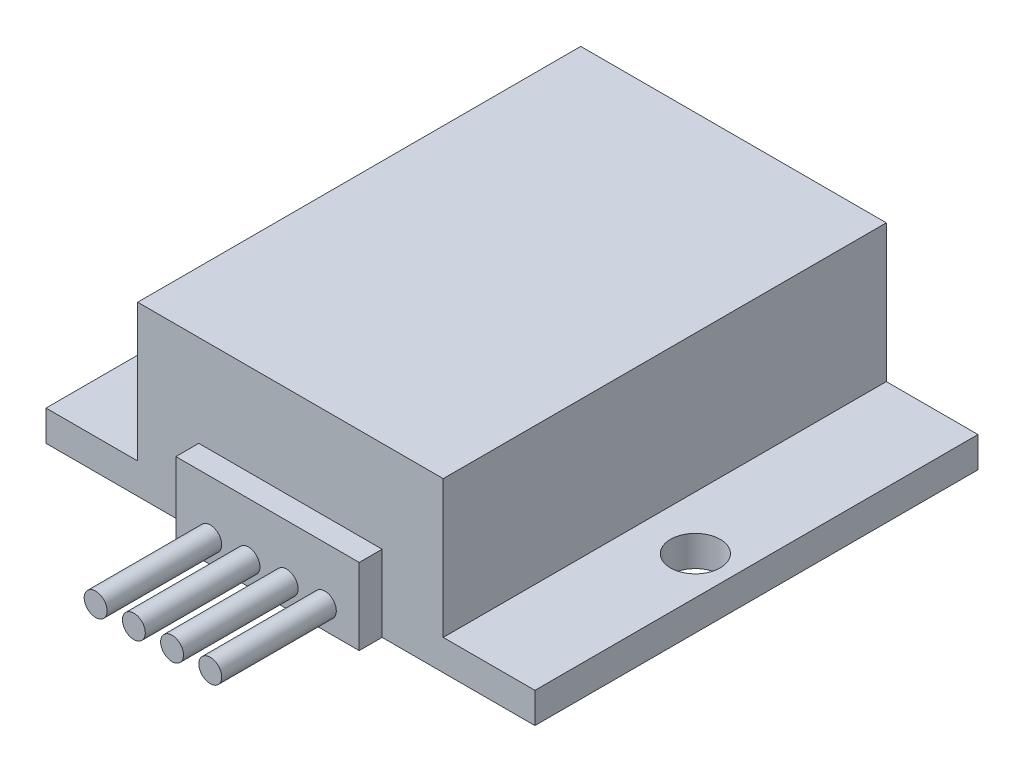
ISO-10303-21;
HEADER;
FILE_DESCRIPTION(('STEP AP214'),'2;1');
FILE_NAME('part.step','',(''),(''),'','','');
FILE_SCHEMA(('AUTOMOTIVE_DESIGN { 1 0 10303 214 1 1 1 1 }'));
ENDSEC;
DATA;
#1=APPLICATION_CONTEXT('core data for automotive mechanical design processes');
#2=APPLICATION_PROTOCOL_DEFINITION('international standard','automotive_design',2000,#1);
#3=PRODUCT_CONTEXT('',#1,'mechanical');
#4=PRODUCT('Part','Part','',(#3));
#5=PRODUCT_RELATED_PRODUCT_CATEGORY('part','',(#4));
#6=PRODUCT_DEFINITION_FORMATION('','',#4);
#7=PRODUCT_DEFINITION_CONTEXT('part definition',#1,'design');
#8=PRODUCT_DEFINITION('design','',#6,#7);
#9=PRODUCT_DEFINITION_SHAPE('','',#8);
#10=(LENGTH_UNIT() NAMED_UNIT(*) SI_UNIT(.MILLI.,.METRE.));
#11=(NAMED_UNIT(*) PLANE_ANGLE_UNIT() SI_UNIT($,.RADIAN.));
#12=(NAMED_UNIT(*) SI_UNIT($,.STERADIAN.) SOLID_ANGLE_UNIT());
#13=UNCERTAINTY_MEASURE_WITH_UNIT(LENGTH_MEASURE(1.E-05),#10,'distance_accuracy_value','');
#14=(GEOMETRIC_REPRESENTATION_CONTEXT(3) GLOBAL_UNCERTAINTY_ASSIGNED_CONTEXT((#13)) GLOBAL_UNIT_ASSIGNED_CONTEXT((#10,
#11,#12)) REPRESENTATION_CONTEXT('',''));
#15=CARTESIAN_POINT('',(0.,0.,0.));
#16=DIRECTION('',(0.,0.,1.));
#17=DIRECTION('',(1.,0.,0.));
#18=AXIS2_PLACEMENT_3D('',#15,#16,#17);
#19=CARTESIAN_POINT('',(0.,4.,29.));
#20=DIRECTION('',(0.,0.,-1.));
#21=DIRECTION('',(-1.,0.,0.));
#22=AXIS2_PLACEMENT_3D('',#19,#20,#21);
#23=PLANE('',#22);
#24=DIRECTION('',(0.,-1.,0.));
#25=VECTOR('',#24,1.);
#26=CARTESIAN_POINT('',(-12.,10.,29.));
#27=LINE('',#26,#25);
#28=CARTESIAN_POINT('',(-12.,10.,29.));
#29=VERTEX_POINT('',#28);
#30=CARTESIAN_POINT('',(-12.,0.,29.));
#31=VERTEX_POINT('',#30);
#32=EDGE_CURVE('E152',#29,#31,#27,.T.);
#33=ORIENTED_EDGE('',*,*,#32,.F.);
#34=DIRECTION('',(1.,0.,0.));
#35=VECTOR('',#34,1.);
#36=CARTESIAN_POINT('',(0.,10.,29.));
#37=LINE('',#36,#35);
#38=CARTESIAN_POINT('',(12.,10.,29.));
#39=VERTEX_POINT('',#38);
#40=EDGE_CURVE('E133',#29,#39,#37,.T.);
#41=ORIENTED_EDGE('',*,*,#40,.T.);
#42=DIRECTION('',(0.,-1.,0.));
#43=VECTOR('',#42,1.);
#44=CARTESIAN_POINT('',(12.,10.,29.));
#45=LINE('',#44,#43);
#46=CARTESIAN_POINT('',(12.,0.,29.));
#47=VERTEX_POINT('',#46);
#48=EDGE_CURVE('E129',#39,#47,#45,.T.);
#49=ORIENTED_EDGE('',*,*,#48,.T.);
#50=DIRECTION('',(1.,0.,0.));
#51=VECTOR('',#50,1.);
#52=CARTESIAN_POINT('',(0.,0.,29.));
#53=LINE('',#52,#51);
#54=CARTESIAN_POINT('',(32.,0.,29.));
#55=VERTEX_POINT('',#54);
#56=EDGE_CURVE('E215',#47,#55,#53,.T.);
#57=ORIENTED_EDGE('',*,*,#56,.T.);
#58=DIRECTION('',(0.,-1.,0.));
#59=VECTOR('',#58,1.);
#60=CARTESIAN_POINT('',(32.,4.,29.));
#61=LINE('',#60,#59);
#62=CARTESIAN_POINT('',(32.,4.,29.));
#63=VERTEX_POINT('',#62);
#64=EDGE_CURVE('E173',#63,#55,#61,.T.);
#65=ORIENTED_EDGE('',*,*,#64,.F.);
#66=DIRECTION('',(1.,0.,0.));
#67=VECTOR('',#66,1.);
#68=CARTESIAN_POINT('',(0.,4.,29.));
#69=LINE('',#68,#67);
#70=CARTESIAN_POINT('',(20.,4.,29.));
#71=VERTEX_POINT('',#70);
#72=EDGE_CURVE('E163',#71,#63,#69,.T.);
#73=ORIENTED_EDGE('',*,*,#72,.F.);
#74=DIRECTION('',(0.,-1.,0.));
#75=VECTOR('',#74,1.);
#76=CARTESIAN_POINT('',(20.,22.,29.));
#77=LINE('',#76,#75);
#78=CARTESIAN_POINT('',(20.,22.,29.));
#79=VERTEX_POINT('',#78);
#80=EDGE_CURVE('E186',#79,#71,#77,.T.);
#81=ORIENTED_EDGE('',*,*,#80,.F.);
#82=DIRECTION('',(1.,0.,0.));
#83=VECTOR('',#82,1.);
#84=CARTESIAN_POINT('',(0.,22.,29.));
#85=LINE('',#84,#83);
#86=CARTESIAN_POINT('',(-20.,22.,29.));
#87=VERTEX_POINT('',#86);
#88=EDGE_CURVE('E184',#87,#79,#85,.T.);
#89=ORIENTED_EDGE('',*,*,#88,.F.);
#90=DIRECTION('',(0.,-1.,0.));
#91=VECTOR('',#90,1.);
#92=CARTESIAN_POINT('',(-20.,22.,29.));
#93=LINE('',#92,#91);
#94=CARTESIAN_POINT('',(-20.,4.,29.));
#95=VERTEX_POINT('',#94);
#96=EDGE_CURVE('E188',#87,#95,#93,.T.);
#97=ORIENTED_EDGE('',*,*,#96,.T.);
#98=DIRECTION('',(1.,0.,0.));
#99=VECTOR('',#98,1.);
#100=CARTESIAN_POINT('',(0.,4.,29.));
#101=LINE('',#100,#99);
#102=CARTESIAN_POINT('',(-32.,4.,29.));
#103=VERTEX_POINT('',#102);
#104=EDGE_CURVE('E206',#103,#95,#101,.T.);
#105=ORIENTED_EDGE('',*,*,#104,.F.);
#106=DIRECTION('',(0.,-1.,0.));
#107=VECTOR('',#106,1.);
#108=CARTESIAN_POINT('',(-32.,4.,29.));
#109=LINE('',#108,#107);
#110=CARTESIAN_POINT('',(-32.,0.,29.));
#111=VERTEX_POINT('',#110);
#112=EDGE_CURVE('E211',#103,#111,#109,.T.);
#113=ORIENTED_EDGE('',*,*,#112,.T.);
#114=EDGE_CURVE('E216',#111,#31,#53,.T.);
#115=ORIENTED_EDGE('',*,*,#114,.T.);
#116=EDGE_LOOP('',(#33,#41,#49,#57,#65,#73,#81,#89,#97,#105,#113,#115));
#117=FACE_BOUND('',#116,.T.);
#118=ADVANCED_FACE('F36',(#117),#23,.F.);
#119=CARTESIAN_POINT('',(0.,4.,-29.));
#120=DIRECTION('',(0.,0.,-1.));
#121=DIRECTION('',(-1.,0.,0.));
#122=AXIS2_PLACEMENT_3D('',#119,#120,#121);
#123=PLANE('',#122);
#124=DIRECTION('',(1.,0.,0.));
#125=VECTOR('',#124,1.);
#126=CARTESIAN_POINT('',(0.,0.,-29.));
#127=LINE('',#126,#125);
#128=CARTESIAN_POINT('',(-32.,0.,-29.));
#129=VERTEX_POINT('',#128);
#130=CARTESIAN_POINT('',(32.,0.,-29.));
#131=VERTEX_POINT('',#130);
#132=EDGE_CURVE('E196',#129,#131,#127,.T.);
#133=ORIENTED_EDGE('',*,*,#132,.F.);
#134=DIRECTION('',(0.,-1.,0.));
#135=VECTOR('',#134,1.);
#136=CARTESIAN_POINT('',(-32.,4.,-29.));
#137=LINE('',#136,#135);
#138=CARTESIAN_POINT('',(-32.,4.,-29.));
#139=VERTEX_POINT('',#138);
#140=EDGE_CURVE('E223',#139,#129,#137,.T.);
#141=ORIENTED_EDGE('',*,*,#140,.F.);
#142=DIRECTION('',(1.,0.,0.));
#143=VECTOR('',#142,1.);
#144=CARTESIAN_POINT('',(0.,4.,-29.));
#145=LINE('',#144,#143);
#146=CARTESIAN_POINT('',(-20.,4.,-29.));
#147=VERTEX_POINT('',#146);
#148=EDGE_CURVE('E200',#139,#147,#145,.T.);
#149=ORIENTED_EDGE('',*,*,#148,.T.);
#150=DIRECTION('',(0.,-1.,0.));
#151=VECTOR('',#150,1.);
#152=CARTESIAN_POINT('',(-20.,22.,-29.));
#153=LINE('',#152,#151);
#154=CARTESIAN_POINT('',(-20.,22.,-29.));
#155=VERTEX_POINT('',#154);
#156=EDGE_CURVE('E191',#155,#147,#153,.T.);
#157=ORIENTED_EDGE('',*,*,#156,.F.);
#158=DIRECTION('',(1.,0.,0.));
#159=VECTOR('',#158,1.);
#160=CARTESIAN_POINT('',(0.,22.,-29.));
#161=LINE('',#160,#159);
#162=CARTESIAN_POINT('',(20.,22.,-29.));
#163=VERTEX_POINT('',#162);
#164=EDGE_CURVE('E179',#155,#163,#161,.T.);
#165=ORIENTED_EDGE('',*,*,#164,.T.);
#166=DIRECTION('',(0.,-1.,0.));
#167=VECTOR('',#166,1.);
#168=CARTESIAN_POINT('',(20.,22.,-29.));
#169=LINE('',#168,#167);
#170=CARTESIAN_POINT('',(20.,4.,-29.));
#171=VERTEX_POINT('',#170);
#172=EDGE_CURVE('E194',#163,#171,#169,.T.);
#173=ORIENTED_EDGE('',*,*,#172,.T.);
#174=DIRECTION('',(1.,0.,0.));
#175=VECTOR('',#174,1.);
#176=CARTESIAN_POINT('',(0.,4.,-29.));
#177=LINE('',#176,#175);
#178=CARTESIAN_POINT('',(32.,4.,-29.));
#179=VERTEX_POINT('',#178);
#180=EDGE_CURVE('E159',#171,#179,#177,.T.);
#181=ORIENTED_EDGE('',*,*,#180,.T.);
#182=DIRECTION('',(0.,-1.,0.));
#183=VECTOR('',#182,1.);
#184=CARTESIAN_POINT('',(32.,4.,-29.));
#185=LINE('',#184,#183);
#186=EDGE_CURVE('E167',#179,#131,#185,.T.);
#187=ORIENTED_EDGE('',*,*,#186,.T.);
#188=EDGE_LOOP('',(#133,#141,#149,#157,#165,#173,#181,#187));
#189=FACE_BOUND('',#188,.T.);
#190=ADVANCED_FACE('F38',(#189),#123,.T.);
#191=CARTESIAN_POINT('',(-32.,4.,0.));
#192=DIRECTION('',(1.,0.,0.));
#193=DIRECTION('',(0.,0.,-1.));
#194=AXIS2_PLACEMENT_3D('',#191,#192,#193);
#195=PLANE('',#194);
#196=DIRECTION('',(0.,0.,1.));
#197=VECTOR('',#196,1.);
#198=CARTESIAN_POINT('',(-32.,0.,0.));
#199=LINE('',#198,#197);
#200=EDGE_CURVE('E213',#129,#111,#199,.T.);
#201=ORIENTED_EDGE('',*,*,#200,.T.);
#202=ORIENTED_EDGE('',*,*,#112,.F.);
#203=DIRECTION('',(0.,0.,1.));
#204=VECTOR('',#203,1.);
#205=CARTESIAN_POINT('',(-32.,4.,0.));
#206=LINE('',#205,#204);
#207=EDGE_CURVE('E204',#139,#103,#206,.T.);
#208=ORIENTED_EDGE('',*,*,#207,.F.);
#209=ORIENTED_EDGE('',*,*,#140,.T.);
#210=EDGE_LOOP('',(#201,#202,#208,#209));
#211=FACE_BOUND('',#210,.T.);
#212=ADVANCED_FACE('F265',(#211),#195,.F.);
#213=CARTESIAN_POINT('',(-27.,4.,3.));
#214=DIRECTION('',(0.,-1.,0.));
#215=DIRECTION('',(0.,0.,-1.));
#216=AXIS2_PLACEMENT_3D('',#213,#214,#215);
#217=CYLINDRICAL_SURFACE('',#216,3.25);
#218=CARTESIAN_POINT('',(-27.,4.,3.));
#219=DIRECTION('',(0.,1.,0.));
#220=DIRECTION('',(0.,0.,1.));
#221=AXIS2_PLACEMENT_3D('',#218,#219,#220);
#222=CIRCLE('',#221,3.25);
#223=CARTESIAN_POINT('',(-27.,4.,6.25));
#224=VERTEX_POINT('',#223);
#225=EDGE_CURVE('E208',#224,#224,#222,.F.);
#226=ORIENTED_EDGE('',*,*,#225,.F.);
#227=EDGE_LOOP('',(#226));
#228=FACE_BOUND('',#227,.T.);
#229=CARTESIAN_POINT('',(-27.,0.,3.));
#230=DIRECTION('',(0.,1.,0.));
#231=DIRECTION('',(0.,0.,1.));
#232=AXIS2_PLACEMENT_3D('',#229,#230,#231);
#233=CIRCLE('',#232,3.25);
#234=CARTESIAN_POINT('',(-27.,0.,6.25));
#235=VERTEX_POINT('',#234);
#236=EDGE_CURVE('E201',#235,#235,#233,.F.);
#237=ORIENTED_EDGE('',*,*,#236,.T.);
#238=EDGE_LOOP('',(#237));
#239=FACE_BOUND('',#238,.T.);
#240=ADVANCED_FACE('F269',(#228,#239),#217,.F.);
#241=CARTESIAN_POINT('',(0.,4.,0.));
#242=DIRECTION('',(0.,1.,0.));
#243=DIRECTION('',(0.,0.,1.));
#244=AXIS2_PLACEMENT_3D('',#241,#242,#243);
#245=PLANE('',#244);
#246=DIRECTION('',(0.,0.,1.));
#247=VECTOR('',#246,1.);
#248=CARTESIAN_POINT('',(-20.,4.,0.));
#249=LINE('',#248,#247);
#250=EDGE_CURVE('E197',#147,#95,#249,.T.);
#251=ORIENTED_EDGE('',*,*,#250,.F.);
#252=ORIENTED_EDGE('',*,*,#148,.F.);
#253=ORIENTED_EDGE('',*,*,#207,.T.);
#254=ORIENTED_EDGE('',*,*,#104,.T.);
#255=EDGE_LOOP('',(#251,#252,#253,#254));
#256=FACE_BOUND('',#255,.T.);
#257=ORIENTED_EDGE('',*,*,#225,.T.);
#258=EDGE_LOOP('',(#257));
#259=FACE_BOUND('',#258,.T.);
#260=ADVANCED_FACE('F276',(#256,#259),#245,.T.);
#261=CARTESIAN_POINT('',(0.,0.,0.));
#262=DIRECTION('',(0.,1.,0.));
#263=DIRECTION('',(0.,0.,1.));
#264=AXIS2_PLACEMENT_3D('',#261,#262,#263);
#265=PLANE('',#264);
#266=ORIENTED_EDGE('',*,*,#132,.T.);
#267=DIRECTION('',(0.,0.,1.));
#268=VECTOR('',#267,1.);
#269=CARTESIAN_POINT('',(32.,0.,0.));
#270=LINE('',#269,#268);
#271=EDGE_CURVE('E150',#131,#55,#270,.T.);
#272=ORIENTED_EDGE('',*,*,#271,.T.);
#273=ORIENTED_EDGE('',*,*,#56,.F.);
#274=DIRECTION('',(0.,0.,-1.));
#275=VECTOR('',#274,1.);
#276=CARTESIAN_POINT('',(11.9999999999999,0.,0.));
#277=LINE('',#276,#275);
#278=CARTESIAN_POINT('',(12.,0.,32.));
#279=VERTEX_POINT('',#278);
#280=EDGE_CURVE('E51',#279,#47,#277,.T.);
#281=ORIENTED_EDGE('',*,*,#280,.F.);
#282=DIRECTION('',(1.,0.,0.));
#283=VECTOR('',#282,1.);
#284=CARTESIAN_POINT('',(0.,0.,32.));
#285=LINE('',#284,#283);
#286=CARTESIAN_POINT('',(-12.,0.,32.));
#287=VERTEX_POINT('',#286);
#288=EDGE_CURVE('E146',#287,#279,#285,.T.);
#289=ORIENTED_EDGE('',*,*,#288,.F.);
#290=DIRECTION('',(0.,0.,1.));
#291=VECTOR('',#290,1.);
#292=CARTESIAN_POINT('',(-12.,0.,0.));
#293=LINE('',#292,#291);
#294=EDGE_CURVE('E142',#31,#287,#293,.T.);
#295=ORIENTED_EDGE('',*,*,#294,.F.);
#296=ORIENTED_EDGE('',*,*,#114,.F.);
#297=ORIENTED_EDGE('',*,*,#200,.F.);
#298=EDGE_LOOP('',(#266,#272,#273,#281,#289,#295,#296,#297));
#299=FACE_BOUND('',#298,.T.);
#300=ORIENTED_EDGE('',*,*,#236,.F.);
#301=EDGE_LOOP('',(#300));
#302=FACE_BOUND('',#301,.T.);
#303=CARTESIAN_POINT('',(27.,0.,3.));
#304=DIRECTION('',(0.,1.,0.));
#305=DIRECTION('',(0.,0.,1.));
#306=AXIS2_PLACEMENT_3D('',#303,#304,#305);
#307=CIRCLE('',#306,3.25);
#308=CARTESIAN_POINT('',(27.,0.,6.25));
#309=VERTEX_POINT('',#308);
#310=EDGE_CURVE('E147',#309,#309,#307,.T.);
#311=ORIENTED_EDGE('',*,*,#310,.T.);
#312=EDGE_LOOP('',(#311));
#313=FACE_BOUND('',#312,.T.);
#314=ADVANCED_FACE('F286',(#299,#302,#313),#265,.F.);
#315=CARTESIAN_POINT('',(-20.,22.,0.));
#316=DIRECTION('',(1.,0.,0.));
#317=DIRECTION('',(0.,0.,-1.));
#318=AXIS2_PLACEMENT_3D('',#315,#316,#317);
#319=PLANE('',#318);
#320=ORIENTED_EDGE('',*,*,#156,.T.);
#321=ORIENTED_EDGE('',*,*,#250,.T.);
#322=ORIENTED_EDGE('',*,*,#96,.F.);
#323=DIRECTION('',(0.,0.,1.));
#324=VECTOR('',#323,1.);
#325=CARTESIAN_POINT('',(-20.,22.,0.));
#326=LINE('',#325,#324);
#327=EDGE_CURVE('E182',#155,#87,#326,.T.);
#328=ORIENTED_EDGE('',*,*,#327,.F.);
#329=EDGE_LOOP('',(#320,#321,#322,#328));
#330=FACE_BOUND('',#329,.T.);
#331=ADVANCED_FACE('F413',(#330),#319,.F.);
#332=CARTESIAN_POINT('',(20.,22.,0.));
#333=DIRECTION('',(1.,0.,0.));
#334=DIRECTION('',(0.,0.,-1.));
#335=AXIS2_PLACEMENT_3D('',#332,#333,#334);
#336=PLANE('',#335);
#337=DIRECTION('',(0.,0.,1.));
#338=VECTOR('',#337,1.);
#339=CARTESIAN_POINT('',(20.,4.,0.));
#340=LINE('',#339,#338);
#341=EDGE_CURVE('E59',#171,#71,#340,.T.);
#342=ORIENTED_EDGE('',*,*,#341,.F.);
#343=ORIENTED_EDGE('',*,*,#172,.F.);
#344=DIRECTION('',(0.,0.,1.));
#345=VECTOR('',#344,1.);
#346=CARTESIAN_POINT('',(20.,22.,0.));
#347=LINE('',#346,#345);
#348=EDGE_CURVE('E176',#163,#79,#347,.T.);
#349=ORIENTED_EDGE('',*,*,#348,.T.);
#350=ORIENTED_EDGE('',*,*,#80,.T.);
#351=EDGE_LOOP('',(#342,#343,#349,#350));
#352=FACE_BOUND('',#351,.T.);
#353=ADVANCED_FACE('F464',(#352),#336,.T.);
#354=CARTESIAN_POINT('',(0.,22.,0.));
#355=DIRECTION('',(0.,1.,0.));
#356=DIRECTION('',(0.,0.,1.));
#357=AXIS2_PLACEMENT_3D('',#354,#355,#356);
#358=PLANE('',#357);
#359=ORIENTED_EDGE('',*,*,#348,.F.);
#360=ORIENTED_EDGE('',*,*,#164,.F.);
#361=ORIENTED_EDGE('',*,*,#327,.T.);
#362=ORIENTED_EDGE('',*,*,#88,.T.);
#363=EDGE_LOOP('',(#359,#360,#361,#362));
#364=FACE_BOUND('',#363,.T.);
#365=ADVANCED_FACE('F453',(#364),#358,.T.);
#366=CARTESIAN_POINT('',(27.,4.,3.));
#367=DIRECTION('',(0.,-1.,0.));
#368=DIRECTION('',(0.,0.,-1.));
#369=AXIS2_PLACEMENT_3D('',#366,#367,#368);
#370=CYLINDRICAL_SURFACE('',#369,3.25);
#371=CARTESIAN_POINT('',(27.,4.,3.));
#372=DIRECTION('',(0.,1.,0.));
#373=DIRECTION('',(0.,0.,1.));
#374=AXIS2_PLACEMENT_3D('',#371,#372,#373);
#375=CIRCLE('',#374,3.25);
#376=CARTESIAN_POINT('',(27.,4.,6.25));
#377=VERTEX_POINT('',#376);
#378=EDGE_CURVE('E156',#377,#377,#375,.T.);
#379=ORIENTED_EDGE('',*,*,#378,.T.);
#380=EDGE_LOOP('',(#379));
#381=FACE_BOUND('',#380,.T.);
#382=ORIENTED_EDGE('',*,*,#310,.F.);
#383=EDGE_LOOP('',(#382));
#384=FACE_BOUND('',#383,.T.);
#385=ADVANCED_FACE('F443',(#381,#384),#370,.F.);
#386=CARTESIAN_POINT('',(32.,4.,0.));
#387=DIRECTION('',(1.,0.,0.));
#388=DIRECTION('',(0.,0.,-1.));
#389=AXIS2_PLACEMENT_3D('',#386,#387,#388);
#390=PLANE('',#389);
#391=ORIENTED_EDGE('',*,*,#271,.F.);
#392=ORIENTED_EDGE('',*,*,#186,.F.);
#393=DIRECTION('',(0.,0.,1.));
#394=VECTOR('',#393,1.);
#395=CARTESIAN_POINT('',(32.,4.,0.));
#396=LINE('',#395,#394);
#397=EDGE_CURVE('E165',#179,#63,#396,.T.);
#398=ORIENTED_EDGE('',*,*,#397,.T.);
#399=ORIENTED_EDGE('',*,*,#64,.T.);
#400=EDGE_LOOP('',(#391,#392,#398,#399));
#401=FACE_BOUND('',#400,.T.);
#402=ADVANCED_FACE('F432',(#401),#390,.T.);
#403=CARTESIAN_POINT('',(0.,4.,0.));
#404=DIRECTION('',(0.,1.,0.));
#405=DIRECTION('',(0.,0.,1.));
#406=AXIS2_PLACEMENT_3D('',#403,#404,#405);
#407=PLANE('',#406);
#408=ORIENTED_EDGE('',*,*,#378,.F.);
#409=EDGE_LOOP('',(#408));
#410=FACE_BOUND('',#409,.T.);
#411=ORIENTED_EDGE('',*,*,#180,.F.);
#412=ORIENTED_EDGE('',*,*,#341,.T.);
#413=ORIENTED_EDGE('',*,*,#72,.T.);
#414=ORIENTED_EDGE('',*,*,#397,.F.);
#415=EDGE_LOOP('',(#411,#412,#413,#414));
#416=FACE_BOUND('',#415,.T.);
#417=ADVANCED_FACE('F237',(#410,#416),#407,.T.);
#418=CARTESIAN_POINT('',(0.,10.,32.));
#419=DIRECTION('',(0.,0.,-1.));
#420=DIRECTION('',(-1.,0.,0.));
#421=AXIS2_PLACEMENT_3D('',#418,#419,#420);
#422=PLANE('',#421);
#423=CARTESIAN_POINT('',(7.50000000000001,3.,32.));
#424=DIRECTION('',(0.,0.,-1.));
#425=DIRECTION('',(-1.,0.,0.));
#426=AXIS2_PLACEMENT_3D('',#423,#424,#425);
#427=CIRCLE('',#426,1.5);
#428=CARTESIAN_POINT('',(6.00000000000001,3.,32.));
#429=VERTEX_POINT('',#428);
#430=EDGE_CURVE('E11',#429,#429,#427,.F.);
#431=ORIENTED_EDGE('',*,*,#430,.F.);
#432=EDGE_LOOP('',(#431));
#433=FACE_BOUND('',#432,.T.);
#434=CARTESIAN_POINT('',(2.50000000000001,3.,32.));
#435=DIRECTION('',(0.,0.,-1.));
#436=DIRECTION('',(-1.,0.,0.));
#437=AXIS2_PLACEMENT_3D('',#434,#435,#436);
#438=CIRCLE('',#437,1.5);
#439=CARTESIAN_POINT('',(1.00000000000001,3.,32.));
#440=VERTEX_POINT('',#439);
#441=EDGE_CURVE('E44',#440,#440,#438,.F.);
#442=ORIENTED_EDGE('',*,*,#441,.F.);
#443=EDGE_LOOP('',(#442));
#444=FACE_BOUND('',#443,.T.);
#445=CARTESIAN_POINT('',(-2.49999999999999,3.,32.));
#446=DIRECTION('',(0.,0.,-1.));
#447=DIRECTION('',(-1.,0.,0.));
#448=AXIS2_PLACEMENT_3D('',#445,#446,#447);
#449=CIRCLE('',#448,1.5);
#450=CARTESIAN_POINT('',(-3.99999999999999,3.,32.));
#451=VERTEX_POINT('',#450);
#452=EDGE_CURVE('E228',#451,#451,#449,.F.);
#453=ORIENTED_EDGE('',*,*,#452,.F.);
#454=EDGE_LOOP('',(#453));
#455=FACE_BOUND('',#454,.T.);
#456=CARTESIAN_POINT('',(-7.49999999999999,3.,32.));
#457=DIRECTION('',(0.,0.,-1.));
#458=DIRECTION('',(-1.,0.,0.));
#459=AXIS2_PLACEMENT_3D('',#456,#457,#458);
#460=CIRCLE('',#459,1.5);
#461=CARTESIAN_POINT('',(-8.99999999999999,3.,32.));
#462=VERTEX_POINT('',#461);
#463=EDGE_CURVE('E225',#462,#462,#460,.F.);
#464=ORIENTED_EDGE('',*,*,#463,.F.);
#465=EDGE_LOOP('',(#464));
#466=FACE_BOUND('',#465,.T.);
#467=ORIENTED_EDGE('',*,*,#288,.T.);
#468=DIRECTION('',(0.,-1.,0.));
#469=VECTOR('',#468,1.);
#470=CARTESIAN_POINT('',(12.,10.,32.));
#471=LINE('',#470,#469);
#472=CARTESIAN_POINT('',(12.,10.,32.));
#473=VERTEX_POINT('',#472);
#474=EDGE_CURVE('E127',#473,#279,#471,.T.);
#475=ORIENTED_EDGE('',*,*,#474,.F.);
#476=DIRECTION('',(1.,0.,0.));
#477=VECTOR('',#476,1.);
#478=CARTESIAN_POINT('',(0.,10.,32.));
#479=LINE('',#478,#477);
#480=CARTESIAN_POINT('',(-12.,10.,32.));
#481=VERTEX_POINT('',#480);
#482=EDGE_CURVE('E134',#481,#473,#479,.T.);
#483=ORIENTED_EDGE('',*,*,#482,.F.);
#484=DIRECTION('',(0.,-1.,0.));
#485=VECTOR('',#484,1.);
#486=CARTESIAN_POINT('',(-12.,10.,32.));
#487=LINE('',#486,#485);
#488=EDGE_CURVE('E293',#481,#287,#487,.T.);
#489=ORIENTED_EDGE('',*,*,#488,.T.);
#490=EDGE_LOOP('',(#467,#475,#483,#489));
#491=FACE_BOUND('',#490,.T.);
#492=ADVANCED_FACE('F144',(#433,#444,#455,#466,#491),#422,.F.);
#493=CARTESIAN_POINT('',(11.9999999999999,10.,0.));
#494=DIRECTION('',(-1.,0.,0.));
#495=DIRECTION('',(0.,0.,1.));
#496=AXIS2_PLACEMENT_3D('',#493,#494,#495);
#497=PLANE('',#496);
#498=ORIENTED_EDGE('',*,*,#280,.T.);
#499=ORIENTED_EDGE('',*,*,#48,.F.);
#500=DIRECTION('',(0.,0.,-1.));
#501=VECTOR('',#500,1.);
#502=CARTESIAN_POINT('',(11.9999999999999,10.,0.));
#503=LINE('',#502,#501);
#504=EDGE_CURVE('E123',#473,#39,#503,.T.);
#505=ORIENTED_EDGE('',*,*,#504,.F.);
#506=ORIENTED_EDGE('',*,*,#474,.T.);
#507=EDGE_LOOP('',(#498,#499,#505,#506));
#508=FACE_BOUND('',#507,.T.);
#509=ADVANCED_FACE('F125',(#508),#497,.F.);
#510=CARTESIAN_POINT('',(-12.,10.,0.));
#511=DIRECTION('',(1.,0.,0.));
#512=DIRECTION('',(0.,0.,-1.));
#513=AXIS2_PLACEMENT_3D('',#510,#511,#512);
#514=PLANE('',#513);
#515=ORIENTED_EDGE('',*,*,#294,.T.);
#516=ORIENTED_EDGE('',*,*,#488,.F.);
#517=DIRECTION('',(0.,0.,1.));
#518=VECTOR('',#517,1.);
#519=CARTESIAN_POINT('',(-12.,10.,0.));
#520=LINE('',#519,#518);
#521=EDGE_CURVE('E138',#29,#481,#520,.T.);
#522=ORIENTED_EDGE('',*,*,#521,.F.);
#523=ORIENTED_EDGE('',*,*,#32,.T.);
#524=EDGE_LOOP('',(#515,#516,#522,#523));
#525=FACE_BOUND('',#524,.T.);
#526=ADVANCED_FACE('F256',(#525),#514,.F.);
#527=CARTESIAN_POINT('',(0.,10.,0.));
#528=DIRECTION('',(0.,1.,0.));
#529=DIRECTION('',(0.,0.,1.));
#530=AXIS2_PLACEMENT_3D('',#527,#528,#529);
#531=PLANE('',#530);
#532=ORIENTED_EDGE('',*,*,#482,.T.);
#533=ORIENTED_EDGE('',*,*,#504,.T.);
#534=ORIENTED_EDGE('',*,*,#40,.F.);
#535=ORIENTED_EDGE('',*,*,#521,.T.);
#536=EDGE_LOOP('',(#532,#533,#534,#535));
#537=FACE_BOUND('',#536,.T.);
#538=ADVANCED_FACE('F137',(#537),#531,.T.);
#539=CARTESIAN_POINT('',(-7.49999999999999,3.,47.));
#540=DIRECTION('',(0.,0.,-1.));
#541=DIRECTION('',(-1.,0.,0.));
#542=AXIS2_PLACEMENT_3D('',#539,#540,#541);
#543=CYLINDRICAL_SURFACE('',#542,1.5);
#544=CARTESIAN_POINT('',(-7.49999999999999,3.,47.));
#545=DIRECTION('',(0.,0.,1.));
#546=DIRECTION('',(1.,0.,0.));
#547=AXIS2_PLACEMENT_3D('',#544,#545,#546);
#548=CIRCLE('',#547,1.5);
#549=CARTESIAN_POINT('',(-5.99999999999999,3.,47.));
#550=VERTEX_POINT('',#549);
#551=EDGE_CURVE('E297',#550,#550,#548,.T.);
#552=ORIENTED_EDGE('',*,*,#551,.F.);
#553=EDGE_LOOP('',(#552));
#554=FACE_BOUND('',#553,.T.);
#555=ORIENTED_EDGE('',*,*,#463,.T.);
#556=EDGE_LOOP('',(#555));
#557=FACE_BOUND('',#556,.T.);
#558=ADVANCED_FACE('F244',(#554,#557),#543,.T.);
#559=CARTESIAN_POINT('',(-7.49999999999999,3.,47.));
#560=DIRECTION('',(0.,0.,1.));
#561=DIRECTION('',(1.,0.,0.));
#562=AXIS2_PLACEMENT_3D('',#559,#560,#561);
#563=PLANE('',#562);
#564=ORIENTED_EDGE('',*,*,#551,.T.);
#565=EDGE_LOOP('',(#564));
#566=FACE_BOUND('',#565,.T.);
#567=ADVANCED_FACE('F246',(#566),#563,.T.);
#568=CARTESIAN_POINT('',(-2.49999999999999,3.,47.));
#569=DIRECTION('',(0.,0.,-1.));
#570=DIRECTION('',(-1.,0.,0.));
#571=AXIS2_PLACEMENT_3D('',#568,#569,#570);
#572=CYLINDRICAL_SURFACE('',#571,1.5);
#573=CARTESIAN_POINT('',(-2.49999999999999,3.,47.));
#574=DIRECTION('',(0.,0.,1.));
#575=DIRECTION('',(1.,0.,0.));
#576=AXIS2_PLACEMENT_3D('',#573,#574,#575);
#577=CIRCLE('',#576,1.5);
#578=CARTESIAN_POINT('',(-0.999999999999991,3.,47.));
#579=VERTEX_POINT('',#578);
#580=EDGE_CURVE('E299',#579,#579,#577,.T.);
#581=ORIENTED_EDGE('',*,*,#580,.F.);
#582=EDGE_LOOP('',(#581));
#583=FACE_BOUND('',#582,.T.);
#584=ORIENTED_EDGE('',*,*,#452,.T.);
#585=EDGE_LOOP('',(#584));
#586=FACE_BOUND('',#585,.T.);
#587=ADVANCED_FACE('F253',(#583,#586),#572,.T.);
#588=CARTESIAN_POINT('',(-2.49999999999999,3.,47.));
#589=DIRECTION('',(0.,0.,1.));
#590=DIRECTION('',(1.,0.,0.));
#591=AXIS2_PLACEMENT_3D('',#588,#589,#590);
#592=PLANE('',#591);
#593=ORIENTED_EDGE('',*,*,#580,.T.);
#594=EDGE_LOOP('',(#593));
#595=FACE_BOUND('',#594,.T.);
#596=ADVANCED_FACE('F329',(#595),#592,.T.);
#597=CARTESIAN_POINT('',(2.50000000000001,3.,47.));
#598=DIRECTION('',(0.,0.,-1.));
#599=DIRECTION('',(-1.,0.,0.));
#600=AXIS2_PLACEMENT_3D('',#597,#598,#599);
#601=CYLINDRICAL_SURFACE('',#600,1.5);
#602=CARTESIAN_POINT('',(2.50000000000001,3.,47.));
#603=DIRECTION('',(0.,0.,1.));
#604=DIRECTION('',(1.,0.,0.));
#605=AXIS2_PLACEMENT_3D('',#602,#603,#604);
#606=CIRCLE('',#605,1.5);
#607=CARTESIAN_POINT('',(4.00000000000001,3.,47.));
#608=VERTEX_POINT('',#607);
#609=EDGE_CURVE('E302',#608,#608,#606,.T.);
#610=ORIENTED_EDGE('',*,*,#609,.F.);
#611=EDGE_LOOP('',(#610));
#612=FACE_BOUND('',#611,.T.);
#613=ORIENTED_EDGE('',*,*,#441,.T.);
#614=EDGE_LOOP('',(#613));
#615=FACE_BOUND('',#614,.T.);
#616=ADVANCED_FACE('F233',(#612,#615),#601,.T.);
#617=CARTESIAN_POINT('',(2.50000000000001,3.,47.));
#618=DIRECTION('',(0.,0.,1.));
#619=DIRECTION('',(1.,0.,0.));
#620=AXIS2_PLACEMENT_3D('',#617,#618,#619);
#621=PLANE('',#620);
#622=ORIENTED_EDGE('',*,*,#609,.T.);
#623=EDGE_LOOP('',(#622));
#624=FACE_BOUND('',#623,.T.);
#625=ADVANCED_FACE('F316',(#624),#621,.T.);
#626=CARTESIAN_POINT('',(7.50000000000001,3.,47.));
#627=DIRECTION('',(0.,0.,-1.));
#628=DIRECTION('',(-1.,0.,0.));
#629=AXIS2_PLACEMENT_3D('',#626,#627,#628);
#630=CYLINDRICAL_SURFACE('',#629,1.5);
#631=CARTESIAN_POINT('',(7.50000000000001,3.,47.));
#632=DIRECTION('',(0.,0.,1.));
#633=DIRECTION('',(1.,0.,0.));
#634=AXIS2_PLACEMENT_3D('',#631,#632,#633);
#635=CIRCLE('',#634,1.5);
#636=CARTESIAN_POINT('',(9.00000000000001,3.,47.));
#637=VERTEX_POINT('',#636);
#638=EDGE_CURVE('E307',#637,#637,#635,.T.);
#639=ORIENTED_EDGE('',*,*,#638,.F.);
#640=EDGE_LOOP('',(#639));
#641=FACE_BOUND('',#640,.T.);
#642=ORIENTED_EDGE('',*,*,#430,.T.);
#643=EDGE_LOOP('',(#642));
#644=FACE_BOUND('',#643,.T.);
#645=ADVANCED_FACE('F313',(#641,#644),#630,.T.);
#646=CARTESIAN_POINT('',(7.50000000000001,3.,47.));
#647=DIRECTION('',(0.,0.,1.));
#648=DIRECTION('',(1.,0.,0.));
#649=AXIS2_PLACEMENT_3D('',#646,#647,#648);
#650=PLANE('',#649);
#651=ORIENTED_EDGE('',*,*,#638,.T.);
#652=EDGE_LOOP('',(#651));
#653=FACE_BOUND('',#652,.T.);
#654=ADVANCED_FACE('F311',(#653),#650,.T.);
#655=CLOSED_SHELL('',(#118,#190,#212,#240,#260,#314,#331,#353,#365,#385,#402,#417,#492,#509,
#526,#538,#558,#567,#587,#596,#616,#625,#645,#654));
#656=MANIFOLD_SOLID_BREP('B2',#655);
#657=ADVANCED_BREP_SHAPE_REPRESENTATION('',(#18,#656),#14);
#658=SHAPE_DEFINITION_REPRESENTATION(#9,#657);
ENDSEC;
END-ISO-10303-21;
